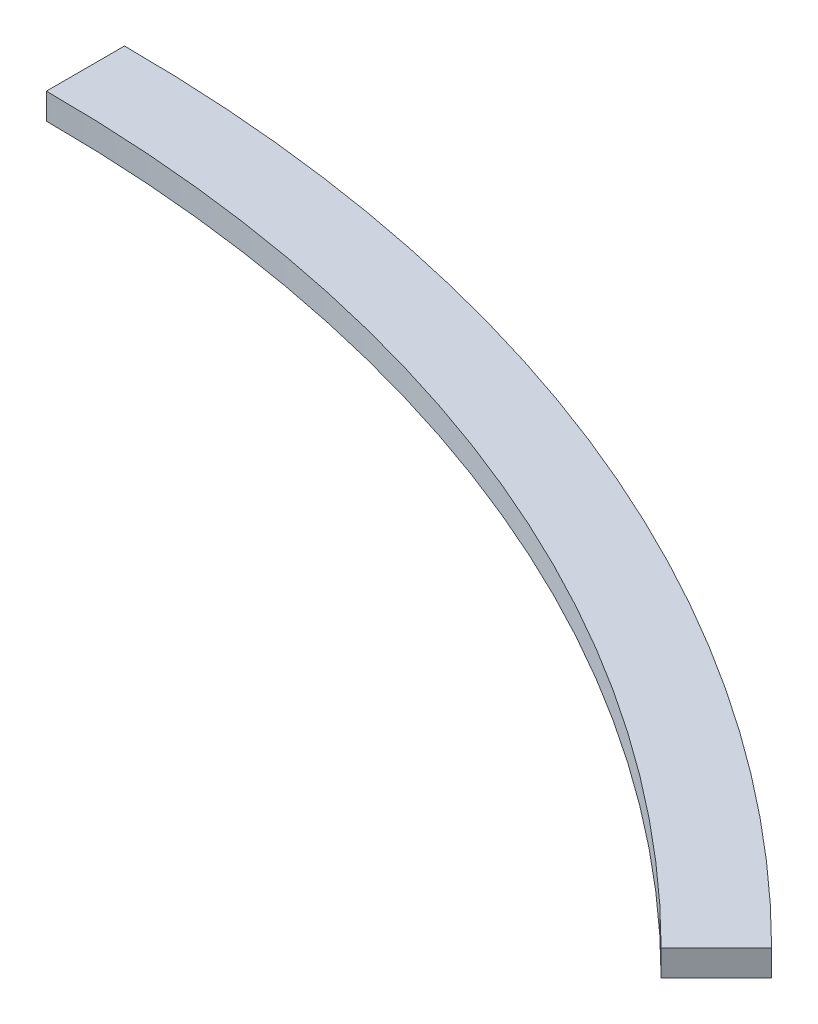
ISO-10303-21;
HEADER;
FILE_DESCRIPTION(('STEP AP214'),'2;1');
FILE_NAME('part.step','',(''),(''),'','','');
FILE_SCHEMA(('AUTOMOTIVE_DESIGN { 1 0 10303 214 1 1 1 1 }'));
ENDSEC;
DATA;
#1=APPLICATION_CONTEXT('core data for automotive mechanical design processes');
#2=APPLICATION_PROTOCOL_DEFINITION('international standard','automotive_design',2000,#1);
#3=PRODUCT_CONTEXT('',#1,'mechanical');
#4=PRODUCT('Part','Part','',(#3));
#5=PRODUCT_RELATED_PRODUCT_CATEGORY('part','',(#4));
#6=PRODUCT_DEFINITION_FORMATION('','',#4);
#7=PRODUCT_DEFINITION_CONTEXT('part definition',#1,'design');
#8=PRODUCT_DEFINITION('design','',#6,#7);
#9=PRODUCT_DEFINITION_SHAPE('','',#8);
#10=(LENGTH_UNIT() NAMED_UNIT(*) SI_UNIT(.MILLI.,.METRE.));
#11=(NAMED_UNIT(*) PLANE_ANGLE_UNIT() SI_UNIT($,.RADIAN.));
#12=(NAMED_UNIT(*) SI_UNIT($,.STERADIAN.) SOLID_ANGLE_UNIT());
#13=UNCERTAINTY_MEASURE_WITH_UNIT(LENGTH_MEASURE(1.E-05),#10,'distance_accuracy_value','');
#14=(GEOMETRIC_REPRESENTATION_CONTEXT(3) GLOBAL_UNCERTAINTY_ASSIGNED_CONTEXT((#13)) GLOBAL_UNIT_ASSIGNED_CONTEXT((#10,
#11,#12)) REPRESENTATION_CONTEXT('',''));
#15=CARTESIAN_POINT('',(0.,0.,0.));
#16=DIRECTION('',(0.,0.,1.));
#17=DIRECTION('',(1.,0.,0.));
#18=AXIS2_PLACEMENT_3D('',#15,#16,#17);
#19=CARTESIAN_POINT('',(0.,10.,0.));
#20=DIRECTION('',(0.,-1.,0.));
#21=DIRECTION('',(0.,0.,-1.));
#22=AXIS2_PLACEMENT_3D('',#19,#20,#21);
#23=CYLINDRICAL_SURFACE('',#22,570.);
#24=CARTESIAN_POINT('',(0.,0.,0.));
#25=DIRECTION('',(0.,-1.,0.));
#26=DIRECTION('',(0.,0.,-1.));
#27=AXIS2_PLACEMENT_3D('',#24,#25,#26);
#28=CIRCLE('',#27,570.);
#29=CARTESIAN_POINT('',(0.,0.,-570.));
#30=VERTEX_POINT('',#29);
#31=CARTESIAN_POINT('',(403.050865276333,0.,-403.050865276331));
#32=VERTEX_POINT('',#31);
#33=EDGE_CURVE('E95',#30,#32,#28,.T.);
#34=ORIENTED_EDGE('',*,*,#33,.T.);
#35=DIRECTION('',(0.,-1.,0.));
#36=VECTOR('',#35,1.);
#37=CARTESIAN_POINT('',(403.050865276333,10.,-403.050865276331));
#38=LINE('',#37,#36);
#39=CARTESIAN_POINT('',(403.050865276333,10.,-403.050865276331));
#40=VERTEX_POINT('',#39);
#41=EDGE_CURVE('E11',#40,#32,#38,.T.);
#42=ORIENTED_EDGE('',*,*,#41,.F.);
#43=CARTESIAN_POINT('',(0.,10.,0.));
#44=DIRECTION('',(0.,-1.,0.));
#45=DIRECTION('',(0.,0.,-1.));
#46=AXIS2_PLACEMENT_3D('',#43,#44,#45);
#47=CIRCLE('',#46,570.);
#48=CARTESIAN_POINT('',(0.,10.,-570.));
#49=VERTEX_POINT('',#48);
#50=EDGE_CURVE('E83',#49,#40,#47,.T.);
#51=ORIENTED_EDGE('',*,*,#50,.F.);
#52=DIRECTION('',(0.,-1.,0.));
#53=VECTOR('',#52,1.);
#54=CARTESIAN_POINT('',(0.,10.,-570.));
#55=LINE('',#54,#53);
#56=EDGE_CURVE('E91',#49,#30,#55,.T.);
#57=ORIENTED_EDGE('',*,*,#56,.T.);
#58=EDGE_LOOP('',(#34,#42,#51,#57));
#59=FACE_BOUND('',#58,.T.);
#60=ADVANCED_FACE('F32',(#59),#23,.F.);
#61=CARTESIAN_POINT('',(403.050865276333,10.,-403.050865276331));
#62=DIRECTION('',(-0.707106781186547,0.,-0.707106781186548));
#63=DIRECTION('',(-0.707106781186548,0.,0.707106781186547));
#64=AXIS2_PLACEMENT_3D('',#61,#62,#63);
#65=PLANE('',#64);
#66=DIRECTION('',(0.707106781186548,0.,-0.707106781186547));
#67=VECTOR('',#66,1.);
#68=CARTESIAN_POINT('',(403.050865276333,0.,-403.050865276331));
#69=LINE('',#68,#67);
#70=CARTESIAN_POINT('',(424.264068711929,0.,-424.264068711928));
#71=VERTEX_POINT('',#70);
#72=EDGE_CURVE('E87',#32,#71,#69,.T.);
#73=ORIENTED_EDGE('',*,*,#72,.T.);
#74=DIRECTION('',(0.,-1.,0.));
#75=VECTOR('',#74,1.);
#76=CARTESIAN_POINT('',(424.264068711929,10.,-424.264068711928));
#77=LINE('',#76,#75);
#78=CARTESIAN_POINT('',(424.264068711929,10.,-424.264068711928));
#79=VERTEX_POINT('',#78);
#80=EDGE_CURVE('E40',#79,#71,#77,.T.);
#81=ORIENTED_EDGE('',*,*,#80,.F.);
#82=DIRECTION('',(0.707106781186548,0.,-0.707106781186547));
#83=VECTOR('',#82,1.);
#84=CARTESIAN_POINT('',(403.050865276333,10.,-403.050865276331));
#85=LINE('',#84,#83);
#86=EDGE_CURVE('E78',#40,#79,#85,.T.);
#87=ORIENTED_EDGE('',*,*,#86,.F.);
#88=ORIENTED_EDGE('',*,*,#41,.T.);
#89=EDGE_LOOP('',(#73,#81,#87,#88));
#90=FACE_BOUND('',#89,.T.);
#91=ADVANCED_FACE('F86',(#90),#65,.F.);
#92=CARTESIAN_POINT('',(0.,10.,0.));
#93=DIRECTION('',(0.,-1.,0.));
#94=DIRECTION('',(0.,0.,-1.));
#95=AXIS2_PLACEMENT_3D('',#92,#93,#94);
#96=CYLINDRICAL_SURFACE('',#95,600.);
#97=CARTESIAN_POINT('',(0.,0.,0.));
#98=DIRECTION('',(0.,1.,0.));
#99=DIRECTION('',(0.,0.,-1.));
#100=AXIS2_PLACEMENT_3D('',#97,#98,#99);
#101=CIRCLE('',#100,600.);
#102=CARTESIAN_POINT('',(0.,0.,-600.));
#103=VERTEX_POINT('',#102);
#104=EDGE_CURVE('E65',#71,#103,#101,.T.);
#105=ORIENTED_EDGE('',*,*,#104,.T.);
#106=DIRECTION('',(0.,-1.,0.));
#107=VECTOR('',#106,1.);
#108=CARTESIAN_POINT('',(0.,10.,-600.));
#109=LINE('',#108,#107);
#110=CARTESIAN_POINT('',(0.,10.,-600.));
#111=VERTEX_POINT('',#110);
#112=EDGE_CURVE('E88',#111,#103,#109,.T.);
#113=ORIENTED_EDGE('',*,*,#112,.F.);
#114=CARTESIAN_POINT('',(0.,10.,0.));
#115=DIRECTION('',(0.,1.,0.));
#116=DIRECTION('',(0.,0.,-1.));
#117=AXIS2_PLACEMENT_3D('',#114,#115,#116);
#118=CIRCLE('',#117,600.);
#119=EDGE_CURVE('E81',#79,#111,#118,.T.);
#120=ORIENTED_EDGE('',*,*,#119,.F.);
#121=ORIENTED_EDGE('',*,*,#80,.T.);
#122=EDGE_LOOP('',(#105,#113,#120,#121));
#123=FACE_BOUND('',#122,.T.);
#124=ADVANCED_FACE('F89',(#123),#96,.T.);
#125=CARTESIAN_POINT('',(0.,10.,-570.));
#126=DIRECTION('',(1.,0.,0.));
#127=DIRECTION('',(0.,0.,-1.));
#128=AXIS2_PLACEMENT_3D('',#125,#126,#127);
#129=PLANE('',#128);
#130=DIRECTION('',(0.,0.,1.));
#131=VECTOR('',#130,1.);
#132=CARTESIAN_POINT('',(0.,0.,-570.));
#133=LINE('',#132,#131);
#134=EDGE_CURVE('E71',#103,#30,#133,.T.);
#135=ORIENTED_EDGE('',*,*,#134,.T.);
#136=ORIENTED_EDGE('',*,*,#56,.F.);
#137=DIRECTION('',(0.,0.,1.));
#138=VECTOR('',#137,1.);
#139=CARTESIAN_POINT('',(0.,10.,-570.));
#140=LINE('',#139,#138);
#141=EDGE_CURVE('E48',#111,#49,#140,.T.);
#142=ORIENTED_EDGE('',*,*,#141,.F.);
#143=ORIENTED_EDGE('',*,*,#112,.T.);
#144=EDGE_LOOP('',(#135,#136,#142,#143));
#145=FACE_BOUND('',#144,.T.);
#146=ADVANCED_FACE('F102',(#145),#129,.F.);
#147=CARTESIAN_POINT('',(0.,10.,0.));
#148=DIRECTION('',(0.,-1.,0.));
#149=DIRECTION('',(0.,0.,-1.));
#150=AXIS2_PLACEMENT_3D('',#147,#148,#149);
#151=PLANE('',#150);
#152=ORIENTED_EDGE('',*,*,#50,.T.);
#153=ORIENTED_EDGE('',*,*,#86,.T.);
#154=ORIENTED_EDGE('',*,*,#119,.T.);
#155=ORIENTED_EDGE('',*,*,#141,.T.);
#156=EDGE_LOOP('',(#152,#153,#154,#155));
#157=FACE_BOUND('',#156,.T.);
#158=ADVANCED_FACE('F79',(#157),#151,.F.);
#159=CARTESIAN_POINT('',(0.,0.,0.));
#160=DIRECTION('',(0.,-1.,0.));
#161=DIRECTION('',(0.,0.,-1.));
#162=AXIS2_PLACEMENT_3D('',#159,#160,#161);
#163=PLANE('',#162);
#164=ORIENTED_EDGE('',*,*,#33,.F.);
#165=ORIENTED_EDGE('',*,*,#134,.F.);
#166=ORIENTED_EDGE('',*,*,#104,.F.);
#167=ORIENTED_EDGE('',*,*,#72,.F.);
#168=EDGE_LOOP('',(#164,#165,#166,#167));
#169=FACE_BOUND('',#168,.T.);
#170=ADVANCED_FACE('F105',(#169),#163,.T.);
#171=CLOSED_SHELL('',(#60,#91,#124,#146,#158,#170));
#172=MANIFOLD_SOLID_BREP('B2',#171);
#173=ADVANCED_BREP_SHAPE_REPRESENTATION('',(#18,#172),#14);
#174=SHAPE_DEFINITION_REPRESENTATION(#9,#173);
ENDSEC;
END-ISO-10303-21;
